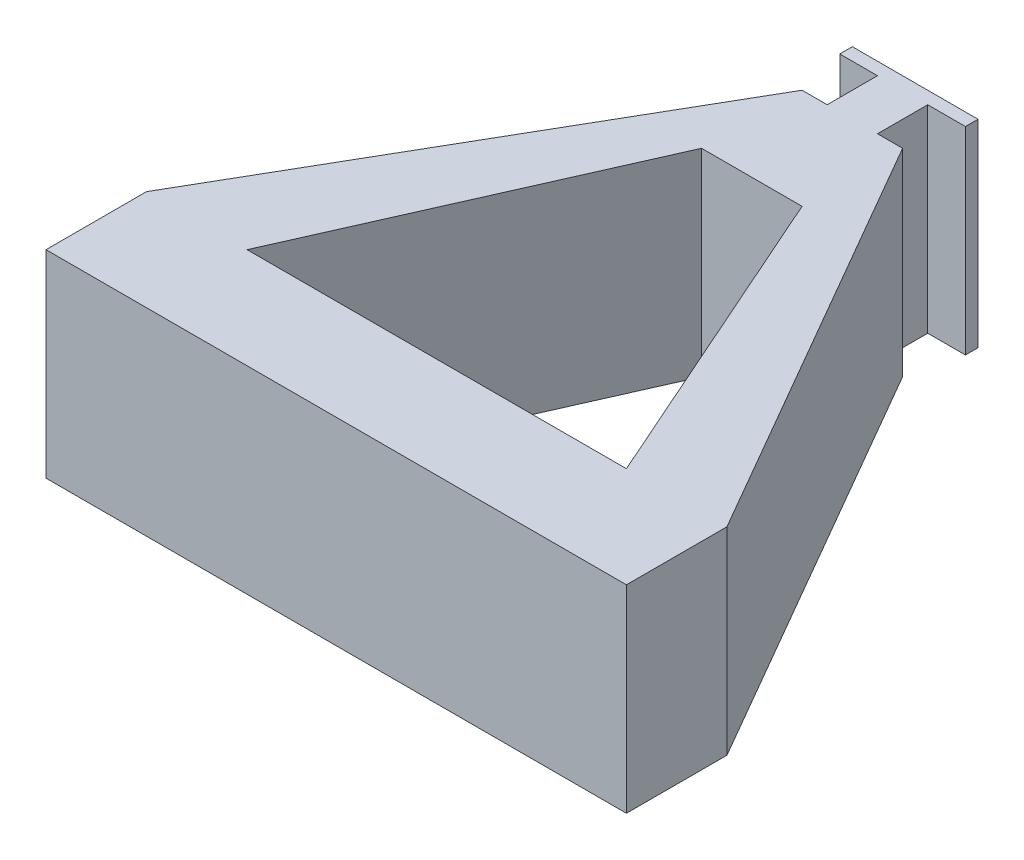
ISO-10303-21;
HEADER;
FILE_DESCRIPTION(('STEP AP214'),'2;1');
FILE_NAME('part.step','',(''),(''),'','','');
FILE_SCHEMA(('AUTOMOTIVE_DESIGN { 1 0 10303 214 1 1 1 1 }'));
ENDSEC;
DATA;
#1=APPLICATION_CONTEXT('core data for automotive mechanical design processes');
#2=APPLICATION_PROTOCOL_DEFINITION('international standard','automotive_design',2000,#1);
#3=PRODUCT_CONTEXT('',#1,'mechanical');
#4=PRODUCT('Part','Part','',(#3));
#5=PRODUCT_RELATED_PRODUCT_CATEGORY('part','',(#4));
#6=PRODUCT_DEFINITION_FORMATION('','',#4);
#7=PRODUCT_DEFINITION_CONTEXT('part definition',#1,'design');
#8=PRODUCT_DEFINITION('design','',#6,#7);
#9=PRODUCT_DEFINITION_SHAPE('','',#8);
#10=(LENGTH_UNIT() NAMED_UNIT(*) SI_UNIT(.MILLI.,.METRE.));
#11=(NAMED_UNIT(*) PLANE_ANGLE_UNIT() SI_UNIT($,.RADIAN.));
#12=(NAMED_UNIT(*) SI_UNIT($,.STERADIAN.) SOLID_ANGLE_UNIT());
#13=UNCERTAINTY_MEASURE_WITH_UNIT(LENGTH_MEASURE(1.E-05),#10,'distance_accuracy_value','');
#14=(GEOMETRIC_REPRESENTATION_CONTEXT(3) GLOBAL_UNCERTAINTY_ASSIGNED_CONTEXT((#13)) GLOBAL_UNIT_ASSIGNED_CONTEXT((#10,
#11,#12)) REPRESENTATION_CONTEXT('',''));
#15=CARTESIAN_POINT('',(0.,0.,0.));
#16=DIRECTION('',(0.,0.,1.));
#17=DIRECTION('',(1.,0.,0.));
#18=AXIS2_PLACEMENT_3D('',#15,#16,#17);
#19=CARTESIAN_POINT('',(0.,100.,-165.4));
#20=DIRECTION('',(0.,0.,-1.));
#21=DIRECTION('',(-1.,0.,0.));
#22=AXIS2_PLACEMENT_3D('',#19,#20,#21);
#23=PLANE('',#22);
#24=DIRECTION('',(1.,0.,0.));
#25=VECTOR('',#24,1.);
#26=CARTESIAN_POINT('',(0.,0.,-165.4));
#27=LINE('',#26,#25);
#28=CARTESIAN_POINT('',(-25.4,0.,-165.4));
#29=VERTEX_POINT('',#28);
#30=CARTESIAN_POINT('',(-12.6999999999999,0.,-165.4));
#31=VERTEX_POINT('',#30);
#32=EDGE_CURVE('E341',#29,#31,#27,.T.);
#33=ORIENTED_EDGE('',*,*,#32,.F.);
#34=DIRECTION('',(0.,-1.,0.));
#35=VECTOR('',#34,1.);
#36=CARTESIAN_POINT('',(-25.4,100.,-165.4));
#37=LINE('',#36,#35);
#38=CARTESIAN_POINT('',(-25.4,100.,-165.4));
#39=VERTEX_POINT('',#38);
#40=EDGE_CURVE('E11',#39,#29,#37,.T.);
#41=ORIENTED_EDGE('',*,*,#40,.F.);
#42=DIRECTION('',(1.,0.,0.));
#43=VECTOR('',#42,1.);
#44=CARTESIAN_POINT('',(0.,100.,-165.4));
#45=LINE('',#44,#43);
#46=CARTESIAN_POINT('',(-12.6999999999999,100.,-165.4));
#47=VERTEX_POINT('',#46);
#48=EDGE_CURVE('E227',#39,#47,#45,.T.);
#49=ORIENTED_EDGE('',*,*,#48,.T.);
#50=DIRECTION('',(0.,-1.,0.));
#51=VECTOR('',#50,1.);
#52=CARTESIAN_POINT('',(-12.6999999999999,100.,-165.4));
#53=LINE('',#52,#51);
#54=EDGE_CURVE('E129',#47,#31,#53,.T.);
#55=ORIENTED_EDGE('',*,*,#54,.T.);
#56=EDGE_LOOP('',(#33,#41,#49,#55));
#57=FACE_BOUND('',#56,.T.);
#58=ADVANCED_FACE('F45',(#57),#23,.T.);
#59=CARTESIAN_POINT('',(-90.6703008929731,100.,-52.3485226280624));
#60=DIRECTION('',(0.866025403784439,0.,0.5));
#61=DIRECTION('',(0.5,0.,-0.866025403784439));
#62=AXIS2_PLACEMENT_3D('',#59,#60,#61);
#63=PLANE('',#62);
#64=DIRECTION('',(-0.5,0.,0.866025403784439));
#65=VECTOR('',#64,1.);
#66=CARTESIAN_POINT('',(-90.6703008929731,0.,-52.3485226280624));
#67=LINE('',#66,#65);
#68=CARTESIAN_POINT('',(-146.643556529822,0.,44.6000000000002));
#69=VERTEX_POINT('',#68);
#70=EDGE_CURVE('E344',#29,#69,#67,.T.);
#71=ORIENTED_EDGE('',*,*,#70,.T.);
#72=DIRECTION('',(0.,-1.,0.));
#73=VECTOR('',#72,1.);
#74=CARTESIAN_POINT('',(-146.643556529822,100.,44.6000000000002));
#75=LINE('',#74,#73);
#76=CARTESIAN_POINT('',(-146.643556529822,100.,44.6000000000002));
#77=VERTEX_POINT('',#76);
#78=EDGE_CURVE('E56',#77,#69,#75,.T.);
#79=ORIENTED_EDGE('',*,*,#78,.F.);
#80=DIRECTION('',(-0.5,0.,0.866025403784439));
#81=VECTOR('',#80,1.);
#82=CARTESIAN_POINT('',(-90.6703008929731,100.,-52.3485226280624));
#83=LINE('',#82,#81);
#84=EDGE_CURVE('E242',#39,#77,#83,.T.);
#85=ORIENTED_EDGE('',*,*,#84,.F.);
#86=ORIENTED_EDGE('',*,*,#40,.T.);
#87=EDGE_LOOP('',(#71,#79,#85,#86));
#88=FACE_BOUND('',#87,.T.);
#89=ADVANCED_FACE('F384',(#88),#63,.F.);
#90=CARTESIAN_POINT('',(-146.643556529822,100.,1.60243162275914E-13));
#91=DIRECTION('',(1.,0.,0.));
#92=DIRECTION('',(0.,0.,-1.));
#93=AXIS2_PLACEMENT_3D('',#90,#91,#92);
#94=PLANE('',#93);
#95=DIRECTION('',(0.,0.,1.));
#96=VECTOR('',#95,1.);
#97=CARTESIAN_POINT('',(-146.643556529822,0.,1.60243162275914E-13));
#98=LINE('',#97,#96);
#99=CARTESIAN_POINT('',(-146.643556529822,0.,95.4));
#100=VERTEX_POINT('',#99);
#101=EDGE_CURVE('E349',#69,#100,#98,.T.);
#102=ORIENTED_EDGE('',*,*,#101,.T.);
#103=DIRECTION('',(0.,-1.,0.));
#104=VECTOR('',#103,1.);
#105=CARTESIAN_POINT('',(-146.643556529822,100.,95.4));
#106=LINE('',#105,#104);
#107=CARTESIAN_POINT('',(-146.643556529822,100.,95.4));
#108=VERTEX_POINT('',#107);
#109=EDGE_CURVE('E300',#108,#100,#106,.T.);
#110=ORIENTED_EDGE('',*,*,#109,.F.);
#111=DIRECTION('',(0.,0.,1.));
#112=VECTOR('',#111,1.);
#113=CARTESIAN_POINT('',(-146.643556529822,100.,1.60243162275914E-13));
#114=LINE('',#113,#112);
#115=EDGE_CURVE('E239',#77,#108,#114,.T.);
#116=ORIENTED_EDGE('',*,*,#115,.F.);
#117=ORIENTED_EDGE('',*,*,#78,.T.);
#118=EDGE_LOOP('',(#102,#110,#116,#117));
#119=FACE_BOUND('',#118,.T.);
#120=ADVANCED_FACE('F388',(#119),#94,.F.);
#121=CARTESIAN_POINT('',(0.,100.,95.4));
#122=DIRECTION('',(0.,0.,1.));
#123=DIRECTION('',(1.,0.,0.));
#124=AXIS2_PLACEMENT_3D('',#121,#122,#123);
#125=PLANE('',#124);
#126=DIRECTION('',(-1.,0.,0.));
#127=VECTOR('',#126,1.);
#128=CARTESIAN_POINT('',(0.,0.,95.4));
#129=LINE('',#128,#127);
#130=CARTESIAN_POINT('',(146.643556529822,0.,95.4));
#131=VERTEX_POINT('',#130);
#132=EDGE_CURVE('E353',#131,#100,#129,.T.);
#133=ORIENTED_EDGE('',*,*,#132,.F.);
#134=DIRECTION('',(0.,-1.,0.));
#135=VECTOR('',#134,1.);
#136=CARTESIAN_POINT('',(146.643556529822,100.,95.4));
#137=LINE('',#136,#135);
#138=CARTESIAN_POINT('',(146.643556529822,100.,95.4));
#139=VERTEX_POINT('',#138);
#140=EDGE_CURVE('E297',#139,#131,#137,.T.);
#141=ORIENTED_EDGE('',*,*,#140,.F.);
#142=DIRECTION('',(-1.,0.,0.));
#143=VECTOR('',#142,1.);
#144=CARTESIAN_POINT('',(0.,100.,95.4));
#145=LINE('',#144,#143);
#146=EDGE_CURVE('E235',#139,#108,#145,.T.);
#147=ORIENTED_EDGE('',*,*,#146,.T.);
#148=ORIENTED_EDGE('',*,*,#109,.T.);
#149=EDGE_LOOP('',(#133,#141,#147,#148));
#150=FACE_BOUND('',#149,.T.);
#151=ADVANCED_FACE('F391',(#150),#125,.T.);
#152=CARTESIAN_POINT('',(146.643556529822,100.,0.));
#153=DIRECTION('',(-1.,0.,0.));
#154=DIRECTION('',(0.,0.,1.));
#155=AXIS2_PLACEMENT_3D('',#152,#153,#154);
#156=PLANE('',#155);
#157=DIRECTION('',(0.,0.,-1.));
#158=VECTOR('',#157,1.);
#159=CARTESIAN_POINT('',(146.643556529822,0.,0.));
#160=LINE('',#159,#158);
#161=CARTESIAN_POINT('',(146.643556529822,0.,44.6));
#162=VERTEX_POINT('',#161);
#163=EDGE_CURVE('E357',#131,#162,#160,.T.);
#164=ORIENTED_EDGE('',*,*,#163,.T.);
#165=DIRECTION('',(0.,-1.,0.));
#166=VECTOR('',#165,1.);
#167=CARTESIAN_POINT('',(146.643556529822,100.,44.6));
#168=LINE('',#167,#166);
#169=CARTESIAN_POINT('',(146.643556529822,100.,44.6));
#170=VERTEX_POINT('',#169);
#171=EDGE_CURVE('E294',#170,#162,#168,.T.);
#172=ORIENTED_EDGE('',*,*,#171,.F.);
#173=DIRECTION('',(0.,0.,-1.));
#174=VECTOR('',#173,1.);
#175=CARTESIAN_POINT('',(146.643556529822,100.,0.));
#176=LINE('',#175,#174);
#177=EDGE_CURVE('E232',#139,#170,#176,.T.);
#178=ORIENTED_EDGE('',*,*,#177,.F.);
#179=ORIENTED_EDGE('',*,*,#140,.T.);
#180=EDGE_LOOP('',(#164,#172,#178,#179));
#181=FACE_BOUND('',#180,.T.);
#182=ADVANCED_FACE('F396',(#181),#156,.F.);
#183=CARTESIAN_POINT('',(90.6703008929731,100.,-52.3485226280624));
#184=DIRECTION('',(0.866025403784438,0.,-0.5));
#185=DIRECTION('',(-0.5,0.,-0.866025403784439));
#186=AXIS2_PLACEMENT_3D('',#183,#184,#185);
#187=PLANE('',#186);
#188=DIRECTION('',(0.5,0.,0.866025403784439));
#189=VECTOR('',#188,1.);
#190=CARTESIAN_POINT('',(90.6703008929731,0.,-52.3485226280624));
#191=LINE('',#190,#189);
#192=CARTESIAN_POINT('',(25.4,0.,-165.4));
#193=VERTEX_POINT('',#192);
#194=EDGE_CURVE('E361',#193,#162,#191,.T.);
#195=ORIENTED_EDGE('',*,*,#194,.F.);
#196=DIRECTION('',(0.,-1.,0.));
#197=VECTOR('',#196,1.);
#198=CARTESIAN_POINT('',(25.4,100.,-165.4));
#199=LINE('',#198,#197);
#200=CARTESIAN_POINT('',(25.4,100.,-165.4));
#201=VERTEX_POINT('',#200);
#202=EDGE_CURVE('E291',#201,#193,#199,.T.);
#203=ORIENTED_EDGE('',*,*,#202,.F.);
#204=DIRECTION('',(0.5,0.,0.866025403784439));
#205=VECTOR('',#204,1.);
#206=CARTESIAN_POINT('',(90.6703008929731,100.,-52.3485226280624));
#207=LINE('',#206,#205);
#208=EDGE_CURVE('E225',#201,#170,#207,.T.);
#209=ORIENTED_EDGE('',*,*,#208,.T.);
#210=ORIENTED_EDGE('',*,*,#171,.T.);
#211=EDGE_LOOP('',(#195,#203,#209,#210));
#212=FACE_BOUND('',#211,.T.);
#213=ADVANCED_FACE('F433',(#212),#187,.T.);
#214=CARTESIAN_POINT('',(12.7000000000001,0.,-165.4));
#215=VERTEX_POINT('',#214);
#216=EDGE_CURVE('E345',#215,#193,#27,.T.);
#217=ORIENTED_EDGE('',*,*,#216,.F.);
#218=DIRECTION('',(0.,-1.,0.));
#219=VECTOR('',#218,1.);
#220=CARTESIAN_POINT('',(12.7000000000001,100.,-165.4));
#221=LINE('',#220,#219);
#222=CARTESIAN_POINT('',(12.7000000000001,100.,-165.4));
#223=VERTEX_POINT('',#222);
#224=EDGE_CURVE('E288',#223,#215,#221,.T.);
#225=ORIENTED_EDGE('',*,*,#224,.F.);
#226=EDGE_CURVE('E220',#223,#201,#45,.T.);
#227=ORIENTED_EDGE('',*,*,#226,.T.);
#228=ORIENTED_EDGE('',*,*,#202,.T.);
#229=EDGE_LOOP('',(#217,#225,#227,#228));
#230=FACE_BOUND('',#229,.T.);
#231=ADVANCED_FACE('F402',(#230),#23,.T.);
#232=CARTESIAN_POINT('',(12.7000000000002,100.,0.));
#233=DIRECTION('',(1.,0.,0.));
#234=DIRECTION('',(0.,0.,-1.));
#235=AXIS2_PLACEMENT_3D('',#232,#233,#234);
#236=PLANE('',#235);
#237=DIRECTION('',(0.,0.,1.));
#238=VECTOR('',#237,1.);
#239=CARTESIAN_POINT('',(12.7000000000002,0.,0.));
#240=LINE('',#239,#238);
#241=CARTESIAN_POINT('',(12.7000000000001,0.,-190.8));
#242=VERTEX_POINT('',#241);
#243=EDGE_CURVE('E365',#242,#215,#240,.T.);
#244=ORIENTED_EDGE('',*,*,#243,.F.);
#245=DIRECTION('',(0.,-1.,0.));
#246=VECTOR('',#245,1.);
#247=CARTESIAN_POINT('',(12.7000000000001,100.,-190.8));
#248=LINE('',#247,#246);
#249=CARTESIAN_POINT('',(12.7000000000001,100.,-190.8));
#250=VERTEX_POINT('',#249);
#251=EDGE_CURVE('E285',#250,#242,#248,.T.);
#252=ORIENTED_EDGE('',*,*,#251,.F.);
#253=DIRECTION('',(0.,0.,1.));
#254=VECTOR('',#253,1.);
#255=CARTESIAN_POINT('',(12.7000000000002,100.,0.));
#256=LINE('',#255,#254);
#257=EDGE_CURVE('E214',#250,#223,#256,.T.);
#258=ORIENTED_EDGE('',*,*,#257,.T.);
#259=ORIENTED_EDGE('',*,*,#224,.T.);
#260=EDGE_LOOP('',(#244,#252,#258,#259));
#261=FACE_BOUND('',#260,.T.);
#262=ADVANCED_FACE('F406',(#261),#236,.T.);
#263=CARTESIAN_POINT('',(0.,100.,-190.8));
#264=DIRECTION('',(0.,0.,1.));
#265=DIRECTION('',(1.,0.,0.));
#266=AXIS2_PLACEMENT_3D('',#263,#264,#265);
#267=PLANE('',#266);
#268=DIRECTION('',(-1.,0.,0.));
#269=VECTOR('',#268,1.);
#270=CARTESIAN_POINT('',(0.,0.,-190.8));
#271=LINE('',#270,#269);
#272=CARTESIAN_POINT('',(31.75,0.,-190.8));
#273=VERTEX_POINT('',#272);
#274=EDGE_CURVE('E268',#273,#242,#271,.T.);
#275=ORIENTED_EDGE('',*,*,#274,.F.);
#276=DIRECTION('',(0.,-1.,0.));
#277=VECTOR('',#276,1.);
#278=CARTESIAN_POINT('',(31.75,100.,-190.8));
#279=LINE('',#278,#277);
#280=CARTESIAN_POINT('',(31.75,100.,-190.8));
#281=VERTEX_POINT('',#280);
#282=EDGE_CURVE('E282',#281,#273,#279,.T.);
#283=ORIENTED_EDGE('',*,*,#282,.F.);
#284=DIRECTION('',(-1.,0.,0.));
#285=VECTOR('',#284,1.);
#286=CARTESIAN_POINT('',(0.,100.,-190.8));
#287=LINE('',#286,#285);
#288=EDGE_CURVE('E205',#281,#250,#287,.T.);
#289=ORIENTED_EDGE('',*,*,#288,.T.);
#290=ORIENTED_EDGE('',*,*,#251,.T.);
#291=EDGE_LOOP('',(#275,#283,#289,#290));
#292=FACE_BOUND('',#291,.T.);
#293=ADVANCED_FACE('F408',(#292),#267,.T.);
#294=CARTESIAN_POINT('',(31.75,100.,0.));
#295=DIRECTION('',(-1.,0.,0.));
#296=DIRECTION('',(0.,0.,1.));
#297=AXIS2_PLACEMENT_3D('',#294,#295,#296);
#298=PLANE('',#297);
#299=DIRECTION('',(0.,0.,-1.));
#300=VECTOR('',#299,1.);
#301=CARTESIAN_POINT('',(31.75,0.,0.));
#302=LINE('',#301,#300);
#303=CARTESIAN_POINT('',(31.75,0.,-197.15));
#304=VERTEX_POINT('',#303);
#305=EDGE_CURVE('E371',#273,#304,#302,.T.);
#306=ORIENTED_EDGE('',*,*,#305,.T.);
#307=DIRECTION('',(0.,-1.,0.));
#308=VECTOR('',#307,1.);
#309=CARTESIAN_POINT('',(31.75,100.,-197.15));
#310=LINE('',#309,#308);
#311=CARTESIAN_POINT('',(31.75,100.,-197.15));
#312=VERTEX_POINT('',#311);
#313=EDGE_CURVE('E278',#312,#304,#310,.T.);
#314=ORIENTED_EDGE('',*,*,#313,.F.);
#315=DIRECTION('',(0.,0.,-1.));
#316=VECTOR('',#315,1.);
#317=CARTESIAN_POINT('',(31.75,100.,0.));
#318=LINE('',#317,#316);
#319=EDGE_CURVE('E213',#281,#312,#318,.T.);
#320=ORIENTED_EDGE('',*,*,#319,.F.);
#321=ORIENTED_EDGE('',*,*,#282,.T.);
#322=EDGE_LOOP('',(#306,#314,#320,#321));
#323=FACE_BOUND('',#322,.T.);
#324=ADVANCED_FACE('F412',(#323),#298,.F.);
#325=CARTESIAN_POINT('',(0.,100.,-197.15));
#326=DIRECTION('',(0.,0.,1.));
#327=DIRECTION('',(1.,0.,0.));
#328=AXIS2_PLACEMENT_3D('',#325,#326,#327);
#329=PLANE('',#328);
#330=DIRECTION('',(-1.,0.,0.));
#331=VECTOR('',#330,1.);
#332=CARTESIAN_POINT('',(0.,0.,-197.15));
#333=LINE('',#332,#331);
#334=CARTESIAN_POINT('',(-31.75,0.,-197.15));
#335=VERTEX_POINT('',#334);
#336=EDGE_CURVE('E374',#304,#335,#333,.T.);
#337=ORIENTED_EDGE('',*,*,#336,.T.);
#338=DIRECTION('',(0.,-1.,0.));
#339=VECTOR('',#338,1.);
#340=CARTESIAN_POINT('',(-31.75,100.,-197.15));
#341=LINE('',#340,#339);
#342=CARTESIAN_POINT('',(-31.75,100.,-197.15));
#343=VERTEX_POINT('',#342);
#344=EDGE_CURVE('E193',#343,#335,#341,.T.);
#345=ORIENTED_EDGE('',*,*,#344,.F.);
#346=DIRECTION('',(-1.,0.,0.));
#347=VECTOR('',#346,1.);
#348=CARTESIAN_POINT('',(0.,100.,-197.15));
#349=LINE('',#348,#347);
#350=EDGE_CURVE('E198',#312,#343,#349,.T.);
#351=ORIENTED_EDGE('',*,*,#350,.F.);
#352=ORIENTED_EDGE('',*,*,#313,.T.);
#353=EDGE_LOOP('',(#337,#345,#351,#352));
#354=FACE_BOUND('',#353,.T.);
#355=ADVANCED_FACE('F413',(#354),#329,.F.);
#356=CARTESIAN_POINT('',(-31.75,100.,0.));
#357=DIRECTION('',(-1.,0.,0.));
#358=DIRECTION('',(0.,0.,1.));
#359=AXIS2_PLACEMENT_3D('',#356,#357,#358);
#360=PLANE('',#359);
#361=DIRECTION('',(0.,0.,-1.));
#362=VECTOR('',#361,1.);
#363=CARTESIAN_POINT('',(-31.75,0.,0.));
#364=LINE('',#363,#362);
#365=CARTESIAN_POINT('',(-31.75,0.,-190.8));
#366=VERTEX_POINT('',#365);
#367=EDGE_CURVE('E187',#366,#335,#364,.T.);
#368=ORIENTED_EDGE('',*,*,#367,.F.);
#369=DIRECTION('',(0.,-1.,0.));
#370=VECTOR('',#369,1.);
#371=CARTESIAN_POINT('',(-31.75,100.,-190.8));
#372=LINE('',#371,#370);
#373=CARTESIAN_POINT('',(-31.75,100.,-190.8));
#374=VERTEX_POINT('',#373);
#375=EDGE_CURVE('E182',#374,#366,#372,.T.);
#376=ORIENTED_EDGE('',*,*,#375,.F.);
#377=DIRECTION('',(0.,0.,-1.));
#378=VECTOR('',#377,1.);
#379=CARTESIAN_POINT('',(-31.75,100.,0.));
#380=LINE('',#379,#378);
#381=EDGE_CURVE('E185',#374,#343,#380,.T.);
#382=ORIENTED_EDGE('',*,*,#381,.T.);
#383=ORIENTED_EDGE('',*,*,#344,.T.);
#384=EDGE_LOOP('',(#368,#376,#382,#383));
#385=FACE_BOUND('',#384,.T.);
#386=ADVANCED_FACE('F184',(#385),#360,.T.);
#387=CARTESIAN_POINT('',(-12.6999999999999,0.,-190.8));
#388=VERTEX_POINT('',#387);
#389=EDGE_CURVE('E263',#388,#366,#271,.T.);
#390=ORIENTED_EDGE('',*,*,#389,.F.);
#391=DIRECTION('',(0.,-1.,0.));
#392=VECTOR('',#391,1.);
#393=CARTESIAN_POINT('',(-12.6999999999999,100.,-190.8));
#394=LINE('',#393,#392);
#395=CARTESIAN_POINT('',(-12.6999999999999,100.,-190.8));
#396=VERTEX_POINT('',#395);
#397=EDGE_CURVE('E122',#396,#388,#394,.T.);
#398=ORIENTED_EDGE('',*,*,#397,.F.);
#399=EDGE_CURVE('E196',#396,#374,#287,.T.);
#400=ORIENTED_EDGE('',*,*,#399,.T.);
#401=ORIENTED_EDGE('',*,*,#375,.T.);
#402=EDGE_LOOP('',(#390,#398,#400,#401));
#403=FACE_BOUND('',#402,.T.);
#404=ADVANCED_FACE('F202',(#403),#267,.T.);
#405=CARTESIAN_POINT('',(-63.6471047014972,100.,-28.1628669472323));
#406=DIRECTION('',(0.914475463040412,0.,0.404641356632047));
#407=DIRECTION('',(0.404641356632047,0.,-0.914475463040412));
#408=AXIS2_PLACEMENT_3D('',#405,#406,#407);
#409=PLANE('',#408);
#410=DIRECTION('',(-0.404641356632047,0.,0.914475463040412));
#411=VECTOR('',#410,1.);
#412=CARTESIAN_POINT('',(-63.6471047014972,0.,-28.1628669472323));
#413=LINE('',#412,#411);
#414=CARTESIAN_POINT('',(-25.4,0.,-114.6));
#415=VERTEX_POINT('',#414);
#416=CARTESIAN_POINT('',(-95.8435565298216,0.,44.6000000000002));
#417=VERTEX_POINT('',#416);
#418=EDGE_CURVE('E328',#415,#417,#413,.T.);
#419=ORIENTED_EDGE('',*,*,#418,.F.);
#420=DIRECTION('',(0.,-1.,0.));
#421=VECTOR('',#420,1.);
#422=CARTESIAN_POINT('',(-25.4,100.,-114.6));
#423=LINE('',#422,#421);
#424=CARTESIAN_POINT('',(-25.4,100.,-114.6));
#425=VERTEX_POINT('',#424);
#426=EDGE_CURVE('E49',#425,#415,#423,.T.);
#427=ORIENTED_EDGE('',*,*,#426,.F.);
#428=DIRECTION('',(-0.404641356632047,0.,0.914475463040412));
#429=VECTOR('',#428,1.);
#430=CARTESIAN_POINT('',(-63.6471047014972,100.,-28.1628669472323));
#431=LINE('',#430,#429);
#432=CARTESIAN_POINT('',(-95.8435565298216,100.,44.6000000000002));
#433=VERTEX_POINT('',#432);
#434=EDGE_CURVE('E257',#425,#433,#431,.T.);
#435=ORIENTED_EDGE('',*,*,#434,.T.);
#436=DIRECTION('',(0.,-1.,0.));
#437=VECTOR('',#436,1.);
#438=CARTESIAN_POINT('',(-95.8435565298216,100.,44.6000000000002));
#439=LINE('',#438,#437);
#440=EDGE_CURVE('E207',#433,#417,#439,.T.);
#441=ORIENTED_EDGE('',*,*,#440,.T.);
#442=EDGE_LOOP('',(#419,#427,#435,#441));
#443=FACE_BOUND('',#442,.T.);
#444=ADVANCED_FACE('F47',(#443),#409,.T.);
#445=CARTESIAN_POINT('',(0.,100.,-114.6));
#446=DIRECTION('',(0.,0.,-1.));
#447=DIRECTION('',(-1.,0.,0.));
#448=AXIS2_PLACEMENT_3D('',#445,#446,#447);
#449=PLANE('',#448);
#450=DIRECTION('',(1.,0.,0.));
#451=VECTOR('',#450,1.);
#452=CARTESIAN_POINT('',(0.,0.,-114.6));
#453=LINE('',#452,#451);
#454=CARTESIAN_POINT('',(25.4,0.,-114.6));
#455=VERTEX_POINT('',#454);
#456=EDGE_CURVE('E322',#415,#455,#453,.T.);
#457=ORIENTED_EDGE('',*,*,#456,.T.);
#458=DIRECTION('',(0.,-1.,0.));
#459=VECTOR('',#458,1.);
#460=CARTESIAN_POINT('',(25.4,100.,-114.6));
#461=LINE('',#460,#459);
#462=CARTESIAN_POINT('',(25.4,100.,-114.6));
#463=VERTEX_POINT('',#462);
#464=EDGE_CURVE('E310',#463,#455,#461,.T.);
#465=ORIENTED_EDGE('',*,*,#464,.F.);
#466=DIRECTION('',(1.,0.,0.));
#467=VECTOR('',#466,1.);
#468=CARTESIAN_POINT('',(0.,100.,-114.6));
#469=LINE('',#468,#467);
#470=EDGE_CURVE('E254',#425,#463,#469,.T.);
#471=ORIENTED_EDGE('',*,*,#470,.F.);
#472=ORIENTED_EDGE('',*,*,#426,.T.);
#473=EDGE_LOOP('',(#457,#465,#471,#472));
#474=FACE_BOUND('',#473,.T.);
#475=ADVANCED_FACE('F321',(#474),#449,.F.);
#476=CARTESIAN_POINT('',(63.6471047014972,100.,-28.1628669472323));
#477=DIRECTION('',(0.914475463040412,0.,-0.404641356632047));
#478=DIRECTION('',(-0.404641356632047,0.,-0.914475463040412));
#479=AXIS2_PLACEMENT_3D('',#476,#477,#478);
#480=PLANE('',#479);
#481=DIRECTION('',(0.404641356632048,0.,0.914475463040412));
#482=VECTOR('',#481,1.);
#483=CARTESIAN_POINT('',(63.6471047014972,0.,-28.1628669472323));
#484=LINE('',#483,#482);
#485=CARTESIAN_POINT('',(95.8435565298215,0.,44.6));
#486=VERTEX_POINT('',#485);
#487=EDGE_CURVE('E330',#455,#486,#484,.T.);
#488=ORIENTED_EDGE('',*,*,#487,.T.);
#489=DIRECTION('',(0.,-1.,0.));
#490=VECTOR('',#489,1.);
#491=CARTESIAN_POINT('',(95.8435565298215,100.,44.6));
#492=LINE('',#491,#490);
#493=CARTESIAN_POINT('',(95.8435565298215,100.,44.6));
#494=VERTEX_POINT('',#493);
#495=EDGE_CURVE('E308',#494,#486,#492,.T.);
#496=ORIENTED_EDGE('',*,*,#495,.F.);
#497=DIRECTION('',(0.404641356632048,0.,0.914475463040412));
#498=VECTOR('',#497,1.);
#499=CARTESIAN_POINT('',(63.6471047014972,100.,-28.1628669472323));
#500=LINE('',#499,#498);
#501=EDGE_CURVE('E251',#463,#494,#500,.T.);
#502=ORIENTED_EDGE('',*,*,#501,.F.);
#503=ORIENTED_EDGE('',*,*,#464,.T.);
#504=EDGE_LOOP('',(#488,#496,#502,#503));
#505=FACE_BOUND('',#504,.T.);
#506=ADVANCED_FACE('F451',(#505),#480,.F.);
#507=CARTESIAN_POINT('',(0.,100.,44.6000000000001));
#508=DIRECTION('',(0.,0.,-1.));
#509=DIRECTION('',(-1.,0.,0.));
#510=AXIS2_PLACEMENT_3D('',#507,#508,#509);
#511=PLANE('',#510);
#512=DIRECTION('',(1.,0.,0.));
#513=VECTOR('',#512,1.);
#514=CARTESIAN_POINT('',(0.,0.,44.6000000000001));
#515=LINE('',#514,#513);
#516=EDGE_CURVE('E338',#417,#486,#515,.T.);
#517=ORIENTED_EDGE('',*,*,#516,.F.);
#518=ORIENTED_EDGE('',*,*,#440,.F.);
#519=DIRECTION('',(1.,0.,0.));
#520=VECTOR('',#519,1.);
#521=CARTESIAN_POINT('',(0.,100.,44.6000000000001));
#522=LINE('',#521,#520);
#523=EDGE_CURVE('E247',#433,#494,#522,.T.);
#524=ORIENTED_EDGE('',*,*,#523,.T.);
#525=ORIENTED_EDGE('',*,*,#495,.T.);
#526=EDGE_LOOP('',(#517,#518,#524,#525));
#527=FACE_BOUND('',#526,.T.);
#528=ADVANCED_FACE('F447',(#527),#511,.T.);
#529=CARTESIAN_POINT('',(-12.7,100.,0.));
#530=DIRECTION('',(1.,0.,0.));
#531=DIRECTION('',(0.,0.,-1.));
#532=AXIS2_PLACEMENT_3D('',#529,#530,#531);
#533=PLANE('',#532);
#534=DIRECTION('',(0.,0.,1.));
#535=VECTOR('',#534,1.);
#536=CARTESIAN_POINT('',(-12.7,0.,0.));
#537=LINE('',#536,#535);
#538=EDGE_CURVE('E259',#388,#31,#537,.T.);
#539=ORIENTED_EDGE('',*,*,#538,.T.);
#540=ORIENTED_EDGE('',*,*,#54,.F.);
#541=DIRECTION('',(0.,0.,1.));
#542=VECTOR('',#541,1.);
#543=CARTESIAN_POINT('',(-12.7,100.,0.));
#544=LINE('',#543,#542);
#545=EDGE_CURVE('E65',#396,#47,#544,.T.);
#546=ORIENTED_EDGE('',*,*,#545,.F.);
#547=ORIENTED_EDGE('',*,*,#397,.T.);
#548=EDGE_LOOP('',(#539,#540,#546,#547));
#549=FACE_BOUND('',#548,.T.);
#550=ADVANCED_FACE('F450',(#549),#533,.F.);
#551=CARTESIAN_POINT('',(0.,100.,0.));
#552=DIRECTION('',(0.,1.,0.));
#553=DIRECTION('',(0.,0.,1.));
#554=AXIS2_PLACEMENT_3D('',#551,#552,#553);
#555=PLANE('',#554);
#556=ORIENTED_EDGE('',*,*,#434,.F.);
#557=ORIENTED_EDGE('',*,*,#470,.T.);
#558=ORIENTED_EDGE('',*,*,#501,.T.);
#559=ORIENTED_EDGE('',*,*,#523,.F.);
#560=EDGE_LOOP('',(#556,#557,#558,#559));
#561=FACE_BOUND('',#560,.T.);
#562=ORIENTED_EDGE('',*,*,#48,.F.);
#563=ORIENTED_EDGE('',*,*,#84,.T.);
#564=ORIENTED_EDGE('',*,*,#115,.T.);
#565=ORIENTED_EDGE('',*,*,#146,.F.);
#566=ORIENTED_EDGE('',*,*,#177,.T.);
#567=ORIENTED_EDGE('',*,*,#208,.F.);
#568=ORIENTED_EDGE('',*,*,#226,.F.);
#569=ORIENTED_EDGE('',*,*,#257,.F.);
#570=ORIENTED_EDGE('',*,*,#288,.F.);
#571=ORIENTED_EDGE('',*,*,#319,.T.);
#572=ORIENTED_EDGE('',*,*,#350,.T.);
#573=ORIENTED_EDGE('',*,*,#381,.F.);
#574=ORIENTED_EDGE('',*,*,#399,.F.);
#575=ORIENTED_EDGE('',*,*,#545,.T.);
#576=EDGE_LOOP('',(#562,#563,#564,#565,#566,#567,#568,#569,#570,#571,#572,#573,#574,#575));
#577=FACE_BOUND('',#576,.T.);
#578=ADVANCED_FACE('F195',(#561,#577),#555,.T.);
#579=CARTESIAN_POINT('',(0.,0.,0.));
#580=DIRECTION('',(0.,1.,0.));
#581=DIRECTION('',(0.,0.,1.));
#582=AXIS2_PLACEMENT_3D('',#579,#580,#581);
#583=PLANE('',#582);
#584=ORIENTED_EDGE('',*,*,#418,.T.);
#585=ORIENTED_EDGE('',*,*,#516,.T.);
#586=ORIENTED_EDGE('',*,*,#487,.F.);
#587=ORIENTED_EDGE('',*,*,#456,.F.);
#588=EDGE_LOOP('',(#584,#585,#586,#587));
#589=FACE_BOUND('',#588,.T.);
#590=ORIENTED_EDGE('',*,*,#32,.T.);
#591=ORIENTED_EDGE('',*,*,#538,.F.);
#592=ORIENTED_EDGE('',*,*,#389,.T.);
#593=ORIENTED_EDGE('',*,*,#367,.T.);
#594=ORIENTED_EDGE('',*,*,#336,.F.);
#595=ORIENTED_EDGE('',*,*,#305,.F.);
#596=ORIENTED_EDGE('',*,*,#274,.T.);
#597=ORIENTED_EDGE('',*,*,#243,.T.);
#598=ORIENTED_EDGE('',*,*,#216,.T.);
#599=ORIENTED_EDGE('',*,*,#194,.T.);
#600=ORIENTED_EDGE('',*,*,#163,.F.);
#601=ORIENTED_EDGE('',*,*,#132,.T.);
#602=ORIENTED_EDGE('',*,*,#101,.F.);
#603=ORIENTED_EDGE('',*,*,#70,.F.);
#604=EDGE_LOOP('',(#590,#591,#592,#593,#594,#595,#596,#597,#598,#599,#600,#601,#602,#603));
#605=FACE_BOUND('',#604,.T.);
#606=ADVANCED_FACE('F325',(#589,#605),#583,.F.);
#607=CLOSED_SHELL('',(#58,#89,#120,#151,#182,#213,#231,#262,#293,#324,#355,#386,#404,#444,#475,
#506,#528,#550,#578,#606));
#608=MANIFOLD_SOLID_BREP('B2',#607);
#609=ADVANCED_BREP_SHAPE_REPRESENTATION('',(#18,#608),#14);
#610=SHAPE_DEFINITION_REPRESENTATION(#9,#609);
ENDSEC;
END-ISO-10303-21;
